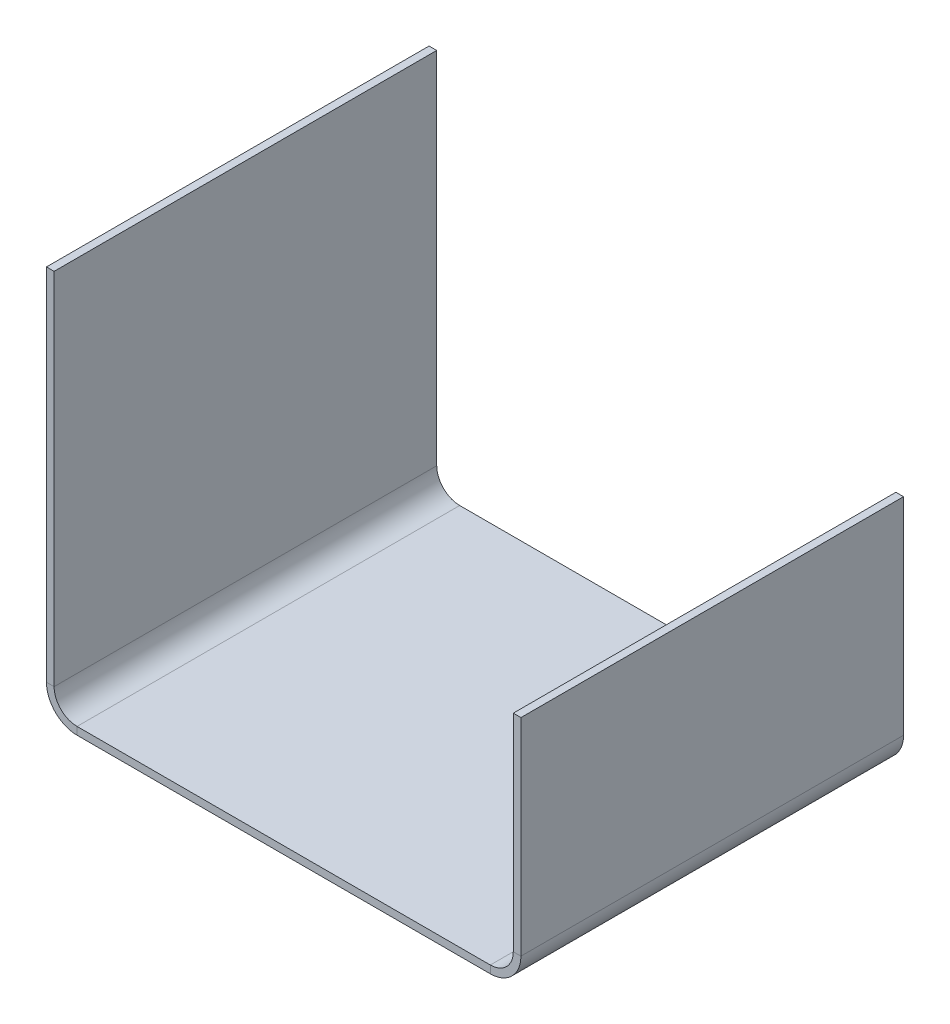
ISO-10303-21;
HEADER;
FILE_DESCRIPTION(('STEP AP214'),'2;1');
FILE_NAME('part.step','',(''),(''),'','','');
FILE_SCHEMA(('AUTOMOTIVE_DESIGN { 1 0 10303 214 1 1 1 1 }'));
ENDSEC;
DATA;
#1=APPLICATION_CONTEXT('core data for automotive mechanical design processes');
#2=APPLICATION_PROTOCOL_DEFINITION('international standard','automotive_design',2000,#1);
#3=PRODUCT_CONTEXT('',#1,'mechanical');
#4=PRODUCT('Part','Part','',(#3));
#5=PRODUCT_RELATED_PRODUCT_CATEGORY('part','',(#4));
#6=PRODUCT_DEFINITION_FORMATION('','',#4);
#7=PRODUCT_DEFINITION_CONTEXT('part definition',#1,'design');
#8=PRODUCT_DEFINITION('design','',#6,#7);
#9=PRODUCT_DEFINITION_SHAPE('','',#8);
#10=(LENGTH_UNIT() NAMED_UNIT(*) SI_UNIT(.MILLI.,.METRE.));
#11=(NAMED_UNIT(*) PLANE_ANGLE_UNIT() SI_UNIT($,.RADIAN.));
#12=(NAMED_UNIT(*) SI_UNIT($,.STERADIAN.) SOLID_ANGLE_UNIT());
#13=UNCERTAINTY_MEASURE_WITH_UNIT(LENGTH_MEASURE(1.E-05),#10,'distance_accuracy_value','');
#14=(GEOMETRIC_REPRESENTATION_CONTEXT(3) GLOBAL_UNCERTAINTY_ASSIGNED_CONTEXT((#13)) GLOBAL_UNIT_ASSIGNED_CONTEXT((#10,
#11,#12)) REPRESENTATION_CONTEXT('',''));
#15=CARTESIAN_POINT('',(0.,0.,0.));
#16=DIRECTION('',(0.,0.,1.));
#17=DIRECTION('',(1.,0.,0.));
#18=AXIS2_PLACEMENT_3D('',#15,#16,#17);
#19=CARTESIAN_POINT('',(-54.,0.,100.));
#20=DIRECTION('',(0.,0.,1.));
#21=DIRECTION('',(1.,0.,0.));
#22=AXIS2_PLACEMENT_3D('',#19,#20,#21);
#23=PLANE('',#22);
#24=DIRECTION('',(0.,-1.,0.));
#25=VECTOR('',#24,1.);
#26=CARTESIAN_POINT('',(-54.,0.,100.));
#27=LINE('',#26,#25);
#28=CARTESIAN_POINT('',(-54.,0.,100.));
#29=VERTEX_POINT('',#28);
#30=CARTESIAN_POINT('',(-54.,-2.,100.));
#31=VERTEX_POINT('',#30);
#32=EDGE_CURVE('E11',#29,#31,#27,.T.);
#33=ORIENTED_EDGE('',*,*,#32,.F.);
#34=CARTESIAN_POINT('',(-54.,6.,100.));
#35=DIRECTION('',(0.,0.,-1.));
#36=DIRECTION('',(-1.,0.,0.));
#37=AXIS2_PLACEMENT_3D('',#34,#35,#36);
#38=CIRCLE('',#37,6.);
#39=CARTESIAN_POINT('',(-60.,6.00000000000001,100.));
#40=VERTEX_POINT('',#39);
#41=EDGE_CURVE('E249',#40,#29,#38,.F.);
#42=ORIENTED_EDGE('',*,*,#41,.F.);
#43=DIRECTION('',(1.,0.,0.));
#44=VECTOR('',#43,1.);
#45=CARTESIAN_POINT('',(-62.,6.,100.));
#46=LINE('',#45,#44);
#47=CARTESIAN_POINT('',(-62.,6.,100.));
#48=VERTEX_POINT('',#47);
#49=EDGE_CURVE('E47',#48,#40,#46,.T.);
#50=ORIENTED_EDGE('',*,*,#49,.F.);
#51=CARTESIAN_POINT('',(-54.,6.,100.));
#52=DIRECTION('',(0.,0.,1.));
#53=DIRECTION('',(1.,0.,0.));
#54=AXIS2_PLACEMENT_3D('',#51,#52,#53);
#55=CIRCLE('',#54,8.);
#56=EDGE_CURVE('E148',#48,#31,#55,.T.);
#57=ORIENTED_EDGE('',*,*,#56,.T.);
#58=EDGE_LOOP('',(#33,#42,#50,#57));
#59=FACE_BOUND('',#58,.T.);
#60=ADVANCED_FACE('F39',(#59),#23,.T.);
#61=CARTESIAN_POINT('',(-62.,6.,100.));
#62=DIRECTION('',(0.,0.,1.));
#63=DIRECTION('',(1.,0.,0.));
#64=AXIS2_PLACEMENT_3D('',#61,#62,#63);
#65=PLANE('',#64);
#66=DIRECTION('',(1.,0.,0.));
#67=VECTOR('',#66,1.);
#68=CARTESIAN_POINT('',(-60.,0.,100.));
#69=LINE('',#68,#67);
#70=CARTESIAN_POINT('',(54.,0.,100.));
#71=VERTEX_POINT('',#70);
#72=EDGE_CURVE('E142',#29,#71,#69,.T.);
#73=ORIENTED_EDGE('',*,*,#72,.F.);
#74=ORIENTED_EDGE('',*,*,#32,.T.);
#75=DIRECTION('',(1.,0.,0.));
#76=VECTOR('',#75,1.);
#77=CARTESIAN_POINT('',(-60.,-2.,100.));
#78=LINE('',#77,#76);
#79=CARTESIAN_POINT('',(54.,-1.99999999999998,100.));
#80=VERTEX_POINT('',#79);
#81=EDGE_CURVE('E139',#31,#80,#78,.T.);
#82=ORIENTED_EDGE('',*,*,#81,.T.);
#83=DIRECTION('',(0.,1.,0.));
#84=VECTOR('',#83,1.);
#85=CARTESIAN_POINT('',(54.,-1.99999999999998,100.));
#86=LINE('',#85,#84);
#87=EDGE_CURVE('E230',#80,#71,#86,.T.);
#88=ORIENTED_EDGE('',*,*,#87,.T.);
#89=EDGE_LOOP('',(#73,#74,#82,#88));
#90=FACE_BOUND('',#89,.T.);
#91=ADVANCED_FACE('F137',(#90),#65,.T.);
#92=CARTESIAN_POINT('',(-60.,6.00000000000001,0.));
#93=DIRECTION('',(0.,0.,-1.));
#94=DIRECTION('',(-1.,0.,0.));
#95=AXIS2_PLACEMENT_3D('',#92,#93,#94);
#96=PLANE('',#95);
#97=DIRECTION('',(-1.,0.,0.));
#98=VECTOR('',#97,1.);
#99=CARTESIAN_POINT('',(-60.,6.00000000000001,0.));
#100=LINE('',#99,#98);
#101=CARTESIAN_POINT('',(-60.,6.00000000000001,0.));
#102=VERTEX_POINT('',#101);
#103=CARTESIAN_POINT('',(-62.,6.,0.));
#104=VERTEX_POINT('',#103);
#105=EDGE_CURVE('E235',#102,#104,#100,.T.);
#106=ORIENTED_EDGE('',*,*,#105,.F.);
#107=CARTESIAN_POINT('',(-54.,6.,0.));
#108=DIRECTION('',(0.,0.,-1.));
#109=DIRECTION('',(-1.,0.,0.));
#110=AXIS2_PLACEMENT_3D('',#107,#108,#109);
#111=CIRCLE('',#110,6.);
#112=CARTESIAN_POINT('',(-54.,0.,0.));
#113=VERTEX_POINT('',#112);
#114=EDGE_CURVE('E187',#102,#113,#111,.F.);
#115=ORIENTED_EDGE('',*,*,#114,.T.);
#116=DIRECTION('',(0.,1.,0.));
#117=VECTOR('',#116,1.);
#118=CARTESIAN_POINT('',(-54.,-2.,0.));
#119=LINE('',#118,#117);
#120=CARTESIAN_POINT('',(-54.,-2.,0.));
#121=VERTEX_POINT('',#120);
#122=EDGE_CURVE('E233',#121,#113,#119,.T.);
#123=ORIENTED_EDGE('',*,*,#122,.F.);
#124=CARTESIAN_POINT('',(-54.,6.,0.));
#125=DIRECTION('',(0.,0.,1.));
#126=DIRECTION('',(1.,0.,0.));
#127=AXIS2_PLACEMENT_3D('',#124,#125,#126);
#128=CIRCLE('',#127,8.);
#129=EDGE_CURVE('E160',#104,#121,#128,.T.);
#130=ORIENTED_EDGE('',*,*,#129,.F.);
#131=EDGE_LOOP('',(#106,#115,#123,#130));
#132=FACE_BOUND('',#131,.T.);
#133=ADVANCED_FACE('F287',(#132),#96,.T.);
#134=CARTESIAN_POINT('',(-54.,-2.,0.));
#135=DIRECTION('',(0.,0.,-1.));
#136=DIRECTION('',(-1.,0.,0.));
#137=AXIS2_PLACEMENT_3D('',#134,#135,#136);
#138=PLANE('',#137);
#139=DIRECTION('',(0.,-1.,0.));
#140=VECTOR('',#139,1.);
#141=CARTESIAN_POINT('',(-60.,100.,0.));
#142=LINE('',#141,#140);
#143=CARTESIAN_POINT('',(-60.,100.,0.));
#144=VERTEX_POINT('',#143);
#145=EDGE_CURVE('E190',#144,#102,#142,.T.);
#146=ORIENTED_EDGE('',*,*,#145,.T.);
#147=ORIENTED_EDGE('',*,*,#105,.T.);
#148=DIRECTION('',(0.,-1.,0.));
#149=VECTOR('',#148,1.);
#150=CARTESIAN_POINT('',(-62.,100.,0.));
#151=LINE('',#150,#149);
#152=CARTESIAN_POINT('',(-62.,100.,0.));
#153=VERTEX_POINT('',#152);
#154=EDGE_CURVE('E196',#153,#104,#151,.T.);
#155=ORIENTED_EDGE('',*,*,#154,.F.);
#156=DIRECTION('',(1.,0.,0.));
#157=VECTOR('',#156,1.);
#158=CARTESIAN_POINT('',(-62.,100.,0.));
#159=LINE('',#158,#157);
#160=EDGE_CURVE('E193',#153,#144,#159,.T.);
#161=ORIENTED_EDGE('',*,*,#160,.T.);
#162=EDGE_LOOP('',(#146,#147,#155,#161));
#163=FACE_BOUND('',#162,.T.);
#164=ADVANCED_FACE('F290',(#163),#138,.T.);
#165=CARTESIAN_POINT('',(60.,6.00000000000002,100.));
#166=DIRECTION('',(0.,0.,1.));
#167=DIRECTION('',(1.,0.,0.));
#168=AXIS2_PLACEMENT_3D('',#165,#166,#167);
#169=PLANE('',#168);
#170=DIRECTION('',(1.,0.,0.));
#171=VECTOR('',#170,1.);
#172=CARTESIAN_POINT('',(60.,6.00000000000002,100.));
#173=LINE('',#172,#171);
#174=CARTESIAN_POINT('',(60.,6.00000000000002,100.));
#175=VERTEX_POINT('',#174);
#176=CARTESIAN_POINT('',(62.,6.00000000000002,100.));
#177=VERTEX_POINT('',#176);
#178=EDGE_CURVE('E55',#175,#177,#173,.T.);
#179=ORIENTED_EDGE('',*,*,#178,.F.);
#180=CARTESIAN_POINT('',(54.,6.00000000000002,100.));
#181=DIRECTION('',(0.,0.,-1.));
#182=DIRECTION('',(-1.,0.,0.));
#183=AXIS2_PLACEMENT_3D('',#180,#181,#182);
#184=CIRCLE('',#183,6.);
#185=EDGE_CURVE('E259',#71,#175,#184,.F.);
#186=ORIENTED_EDGE('',*,*,#185,.F.);
#187=ORIENTED_EDGE('',*,*,#87,.F.);
#188=CARTESIAN_POINT('',(54.,6.00000000000002,100.));
#189=DIRECTION('',(0.,0.,1.));
#190=DIRECTION('',(1.,0.,0.));
#191=AXIS2_PLACEMENT_3D('',#188,#189,#190);
#192=CIRCLE('',#191,8.);
#193=EDGE_CURVE('E168',#80,#177,#192,.T.);
#194=ORIENTED_EDGE('',*,*,#193,.T.);
#195=EDGE_LOOP('',(#179,#186,#187,#194));
#196=FACE_BOUND('',#195,.T.);
#197=ADVANCED_FACE('F282',(#196),#169,.T.);
#198=CARTESIAN_POINT('',(54.,-1.99999999999998,100.));
#199=DIRECTION('',(0.,0.,1.));
#200=DIRECTION('',(1.,0.,0.));
#201=AXIS2_PLACEMENT_3D('',#198,#199,#200);
#202=PLANE('',#201);
#203=DIRECTION('',(0.,1.,0.));
#204=VECTOR('',#203,1.);
#205=CARTESIAN_POINT('',(60.,0.,100.));
#206=LINE('',#205,#204);
#207=CARTESIAN_POINT('',(60.,60.,100.));
#208=VERTEX_POINT('',#207);
#209=EDGE_CURVE('E262',#175,#208,#206,.T.);
#210=ORIENTED_EDGE('',*,*,#209,.F.);
#211=ORIENTED_EDGE('',*,*,#178,.T.);
#212=DIRECTION('',(0.,1.,0.));
#213=VECTOR('',#212,1.);
#214=CARTESIAN_POINT('',(62.,0.,100.));
#215=LINE('',#214,#213);
#216=CARTESIAN_POINT('',(62.,60.,100.));
#217=VERTEX_POINT('',#216);
#218=EDGE_CURVE('E109',#177,#217,#215,.T.);
#219=ORIENTED_EDGE('',*,*,#218,.T.);
#220=DIRECTION('',(1.,0.,0.));
#221=VECTOR('',#220,1.);
#222=CARTESIAN_POINT('',(60.,60.,100.));
#223=LINE('',#222,#221);
#224=EDGE_CURVE('E265',#208,#217,#223,.T.);
#225=ORIENTED_EDGE('',*,*,#224,.F.);
#226=EDGE_LOOP('',(#210,#211,#219,#225));
#227=FACE_BOUND('',#226,.T.);
#228=ADVANCED_FACE('F271',(#227),#202,.T.);
#229=CARTESIAN_POINT('',(54.,0.,0.));
#230=DIRECTION('',(0.,0.,-1.));
#231=DIRECTION('',(-1.,0.,0.));
#232=AXIS2_PLACEMENT_3D('',#229,#230,#231);
#233=PLANE('',#232);
#234=DIRECTION('',(0.,-1.,0.));
#235=VECTOR('',#234,1.);
#236=CARTESIAN_POINT('',(54.,0.,0.));
#237=LINE('',#236,#235);
#238=CARTESIAN_POINT('',(54.,0.,0.));
#239=VERTEX_POINT('',#238);
#240=CARTESIAN_POINT('',(54.,-1.99999999999998,0.));
#241=VERTEX_POINT('',#240);
#242=EDGE_CURVE('E96',#239,#241,#237,.T.);
#243=ORIENTED_EDGE('',*,*,#242,.F.);
#244=CARTESIAN_POINT('',(54.,6.00000000000002,0.));
#245=DIRECTION('',(0.,0.,-1.));
#246=DIRECTION('',(-1.,0.,0.));
#247=AXIS2_PLACEMENT_3D('',#244,#245,#246);
#248=CIRCLE('',#247,6.);
#249=CARTESIAN_POINT('',(60.,6.00000000000002,0.));
#250=VERTEX_POINT('',#249);
#251=EDGE_CURVE('E183',#239,#250,#248,.F.);
#252=ORIENTED_EDGE('',*,*,#251,.T.);
#253=DIRECTION('',(-1.,0.,0.));
#254=VECTOR('',#253,1.);
#255=CARTESIAN_POINT('',(62.,6.00000000000002,0.));
#256=LINE('',#255,#254);
#257=CARTESIAN_POINT('',(62.,6.00000000000002,0.));
#258=VERTEX_POINT('',#257);
#259=EDGE_CURVE('E103',#258,#250,#256,.T.);
#260=ORIENTED_EDGE('',*,*,#259,.F.);
#261=CARTESIAN_POINT('',(54.,6.00000000000002,0.));
#262=DIRECTION('',(0.,0.,1.));
#263=DIRECTION('',(1.,0.,0.));
#264=AXIS2_PLACEMENT_3D('',#261,#262,#263);
#265=CIRCLE('',#264,8.);
#266=EDGE_CURVE('E202',#241,#258,#265,.T.);
#267=ORIENTED_EDGE('',*,*,#266,.F.);
#268=EDGE_LOOP('',(#243,#252,#260,#267));
#269=FACE_BOUND('',#268,.T.);
#270=ADVANCED_FACE('F319',(#269),#233,.T.);
#271=CARTESIAN_POINT('',(62.,6.00000000000002,0.));
#272=DIRECTION('',(0.,0.,-1.));
#273=DIRECTION('',(-1.,0.,0.));
#274=AXIS2_PLACEMENT_3D('',#271,#272,#273);
#275=PLANE('',#274);
#276=DIRECTION('',(1.,0.,0.));
#277=VECTOR('',#276,1.);
#278=CARTESIAN_POINT('',(-60.,0.,0.));
#279=LINE('',#278,#277);
#280=EDGE_CURVE('E185',#113,#239,#279,.T.);
#281=ORIENTED_EDGE('',*,*,#280,.T.);
#282=ORIENTED_EDGE('',*,*,#242,.T.);
#283=DIRECTION('',(1.,0.,0.));
#284=VECTOR('',#283,1.);
#285=CARTESIAN_POINT('',(-60.,-2.,0.));
#286=LINE('',#285,#284);
#287=EDGE_CURVE('E200',#121,#241,#286,.T.);
#288=ORIENTED_EDGE('',*,*,#287,.F.);
#289=ORIENTED_EDGE('',*,*,#122,.T.);
#290=EDGE_LOOP('',(#281,#282,#288,#289));
#291=FACE_BOUND('',#290,.T.);
#292=ADVANCED_FACE('F322',(#291),#275,.T.);
#293=CARTESIAN_POINT('',(62.,0.,100.));
#294=DIRECTION('',(-1.,0.,0.));
#295=DIRECTION('',(0.,0.,1.));
#296=AXIS2_PLACEMENT_3D('',#293,#294,#295);
#297=PLANE('',#296);
#298=DIRECTION('',(0.,1.,0.));
#299=VECTOR('',#298,1.);
#300=CARTESIAN_POINT('',(62.,0.,0.));
#301=LINE('',#300,#299);
#302=CARTESIAN_POINT('',(62.,60.,0.));
#303=VERTEX_POINT('',#302);
#304=EDGE_CURVE('E174',#258,#303,#301,.T.);
#305=ORIENTED_EDGE('',*,*,#304,.T.);
#306=DIRECTION('',(0.,0.,-1.));
#307=VECTOR('',#306,1.);
#308=CARTESIAN_POINT('',(62.,60.,100.));
#309=LINE('',#308,#307);
#310=EDGE_CURVE('E226',#217,#303,#309,.T.);
#311=ORIENTED_EDGE('',*,*,#310,.F.);
#312=ORIENTED_EDGE('',*,*,#218,.F.);
#313=DIRECTION('',(0.,0.,-1.));
#314=VECTOR('',#313,1.);
#315=CARTESIAN_POINT('',(62.,6.00000000000002,100.));
#316=LINE('',#315,#314);
#317=EDGE_CURVE('E170',#177,#258,#316,.T.);
#318=ORIENTED_EDGE('',*,*,#317,.T.);
#319=EDGE_LOOP('',(#305,#311,#312,#318));
#320=FACE_BOUND('',#319,.T.);
#321=ADVANCED_FACE('F325',(#320),#297,.F.);
#322=CARTESIAN_POINT('',(60.,60.,100.));
#323=DIRECTION('',(0.,1.,0.));
#324=DIRECTION('',(0.,0.,1.));
#325=AXIS2_PLACEMENT_3D('',#322,#323,#324);
#326=PLANE('',#325);
#327=DIRECTION('',(1.,0.,0.));
#328=VECTOR('',#327,1.);
#329=CARTESIAN_POINT('',(60.,60.,0.));
#330=LINE('',#329,#328);
#331=CARTESIAN_POINT('',(60.,60.,0.));
#332=VERTEX_POINT('',#331);
#333=EDGE_CURVE('E177',#332,#303,#330,.T.);
#334=ORIENTED_EDGE('',*,*,#333,.F.);
#335=DIRECTION('',(0.,0.,-1.));
#336=VECTOR('',#335,1.);
#337=CARTESIAN_POINT('',(60.,60.,100.));
#338=LINE('',#337,#336);
#339=EDGE_CURVE('E224',#208,#332,#338,.T.);
#340=ORIENTED_EDGE('',*,*,#339,.F.);
#341=ORIENTED_EDGE('',*,*,#224,.T.);
#342=ORIENTED_EDGE('',*,*,#310,.T.);
#343=EDGE_LOOP('',(#334,#340,#341,#342));
#344=FACE_BOUND('',#343,.T.);
#345=ADVANCED_FACE('F270',(#344),#326,.T.);
#346=CARTESIAN_POINT('',(60.,0.,100.));
#347=DIRECTION('',(-1.,0.,0.));
#348=DIRECTION('',(0.,0.,1.));
#349=AXIS2_PLACEMENT_3D('',#346,#347,#348);
#350=PLANE('',#349);
#351=DIRECTION('',(0.,1.,0.));
#352=VECTOR('',#351,1.);
#353=CARTESIAN_POINT('',(60.,0.,0.));
#354=LINE('',#353,#352);
#355=EDGE_CURVE('E180',#250,#332,#354,.T.);
#356=ORIENTED_EDGE('',*,*,#355,.F.);
#357=DIRECTION('',(0.,0.,-1.));
#358=VECTOR('',#357,1.);
#359=CARTESIAN_POINT('',(60.,6.00000000000002,100.));
#360=LINE('',#359,#358);
#361=EDGE_CURVE('E221',#175,#250,#360,.T.);
#362=ORIENTED_EDGE('',*,*,#361,.F.);
#363=ORIENTED_EDGE('',*,*,#209,.T.);
#364=ORIENTED_EDGE('',*,*,#339,.T.);
#365=EDGE_LOOP('',(#356,#362,#363,#364));
#366=FACE_BOUND('',#365,.T.);
#367=ADVANCED_FACE('F275',(#366),#350,.T.);
#368=CARTESIAN_POINT('',(54.,6.00000000000002,100.));
#369=DIRECTION('',(0.,0.,-1.));
#370=DIRECTION('',(-1.,0.,0.));
#371=AXIS2_PLACEMENT_3D('',#368,#369,#370);
#372=CYLINDRICAL_SURFACE('',#371,6.);
#373=ORIENTED_EDGE('',*,*,#251,.F.);
#374=DIRECTION('',(0.,0.,-1.));
#375=VECTOR('',#374,1.);
#376=CARTESIAN_POINT('',(54.,0.,100.));
#377=LINE('',#376,#375);
#378=EDGE_CURVE('E218',#71,#239,#377,.T.);
#379=ORIENTED_EDGE('',*,*,#378,.F.);
#380=ORIENTED_EDGE('',*,*,#185,.T.);
#381=ORIENTED_EDGE('',*,*,#361,.T.);
#382=EDGE_LOOP('',(#373,#379,#380,#381));
#383=FACE_BOUND('',#382,.T.);
#384=ADVANCED_FACE('F278',(#383),#372,.F.);
#385=CARTESIAN_POINT('',(-60.,0.,100.));
#386=DIRECTION('',(0.,1.,0.));
#387=DIRECTION('',(-1.,0.,0.));
#388=AXIS2_PLACEMENT_3D('',#385,#386,#387);
#389=PLANE('',#388);
#390=ORIENTED_EDGE('',*,*,#280,.F.);
#391=DIRECTION('',(0.,0.,-1.));
#392=VECTOR('',#391,1.);
#393=CARTESIAN_POINT('',(-54.,0.,100.));
#394=LINE('',#393,#392);
#395=EDGE_CURVE('E215',#29,#113,#394,.T.);
#396=ORIENTED_EDGE('',*,*,#395,.F.);
#397=ORIENTED_EDGE('',*,*,#72,.T.);
#398=ORIENTED_EDGE('',*,*,#378,.T.);
#399=EDGE_LOOP('',(#390,#396,#397,#398));
#400=FACE_BOUND('',#399,.T.);
#401=ADVANCED_FACE('F285',(#400),#389,.T.);
#402=CARTESIAN_POINT('',(-54.,6.,100.));
#403=DIRECTION('',(0.,0.,-1.));
#404=DIRECTION('',(-1.,0.,0.));
#405=AXIS2_PLACEMENT_3D('',#402,#403,#404);
#406=CYLINDRICAL_SURFACE('',#405,6.);
#407=ORIENTED_EDGE('',*,*,#114,.F.);
#408=DIRECTION('',(0.,0.,-1.));
#409=VECTOR('',#408,1.);
#410=CARTESIAN_POINT('',(-60.,6.00000000000001,100.));
#411=LINE('',#410,#409);
#412=EDGE_CURVE('E212',#40,#102,#411,.T.);
#413=ORIENTED_EDGE('',*,*,#412,.F.);
#414=ORIENTED_EDGE('',*,*,#41,.T.);
#415=ORIENTED_EDGE('',*,*,#395,.T.);
#416=EDGE_LOOP('',(#407,#413,#414,#415));
#417=FACE_BOUND('',#416,.T.);
#418=ADVANCED_FACE('F248',(#417),#406,.F.);
#419=CARTESIAN_POINT('',(-60.,100.,100.));
#420=DIRECTION('',(1.,0.,0.));
#421=DIRECTION('',(0.,1.,0.));
#422=AXIS2_PLACEMENT_3D('',#419,#420,#421);
#423=PLANE('',#422);
#424=ORIENTED_EDGE('',*,*,#145,.F.);
#425=DIRECTION('',(0.,0.,-1.));
#426=VECTOR('',#425,1.);
#427=CARTESIAN_POINT('',(-60.,100.,100.));
#428=LINE('',#427,#426);
#429=CARTESIAN_POINT('',(-60.,100.,100.));
#430=VERTEX_POINT('',#429);
#431=EDGE_CURVE('E210',#430,#144,#428,.T.);
#432=ORIENTED_EDGE('',*,*,#431,.F.);
#433=DIRECTION('',(0.,-1.,0.));
#434=VECTOR('',#433,1.);
#435=CARTESIAN_POINT('',(-60.,100.,100.));
#436=LINE('',#435,#434);
#437=EDGE_CURVE('E242',#430,#40,#436,.T.);
#438=ORIENTED_EDGE('',*,*,#437,.T.);
#439=ORIENTED_EDGE('',*,*,#412,.T.);
#440=EDGE_LOOP('',(#424,#432,#438,#439));
#441=FACE_BOUND('',#440,.T.);
#442=ADVANCED_FACE('F253',(#441),#423,.T.);
#443=CARTESIAN_POINT('',(-62.,100.,100.));
#444=DIRECTION('',(0.,1.,0.));
#445=DIRECTION('',(0.,0.,1.));
#446=AXIS2_PLACEMENT_3D('',#443,#444,#445);
#447=PLANE('',#446);
#448=ORIENTED_EDGE('',*,*,#160,.F.);
#449=DIRECTION('',(0.,0.,-1.));
#450=VECTOR('',#449,1.);
#451=CARTESIAN_POINT('',(-62.,100.,100.));
#452=LINE('',#451,#450);
#453=CARTESIAN_POINT('',(-62.,100.,100.));
#454=VERTEX_POINT('',#453);
#455=EDGE_CURVE('E208',#454,#153,#452,.T.);
#456=ORIENTED_EDGE('',*,*,#455,.F.);
#457=DIRECTION('',(1.,0.,0.));
#458=VECTOR('',#457,1.);
#459=CARTESIAN_POINT('',(-62.,100.,100.));
#460=LINE('',#459,#458);
#461=EDGE_CURVE('E254',#454,#430,#460,.T.);
#462=ORIENTED_EDGE('',*,*,#461,.T.);
#463=ORIENTED_EDGE('',*,*,#431,.T.);
#464=EDGE_LOOP('',(#448,#456,#462,#463));
#465=FACE_BOUND('',#464,.T.);
#466=ADVANCED_FACE('F295',(#465),#447,.T.);
#467=CARTESIAN_POINT('',(-62.,100.,100.));
#468=DIRECTION('',(1.,0.,0.));
#469=DIRECTION('',(0.,1.,0.));
#470=AXIS2_PLACEMENT_3D('',#467,#468,#469);
#471=PLANE('',#470);
#472=ORIENTED_EDGE('',*,*,#154,.T.);
#473=DIRECTION('',(0.,0.,-1.));
#474=VECTOR('',#473,1.);
#475=CARTESIAN_POINT('',(-62.,6.,100.));
#476=LINE('',#475,#474);
#477=EDGE_CURVE('E162',#48,#104,#476,.T.);
#478=ORIENTED_EDGE('',*,*,#477,.F.);
#479=DIRECTION('',(0.,-1.,0.));
#480=VECTOR('',#479,1.);
#481=CARTESIAN_POINT('',(-62.,100.,100.));
#482=LINE('',#481,#480);
#483=EDGE_CURVE('E153',#454,#48,#482,.T.);
#484=ORIENTED_EDGE('',*,*,#483,.F.);
#485=ORIENTED_EDGE('',*,*,#455,.T.);
#486=EDGE_LOOP('',(#472,#478,#484,#485));
#487=FACE_BOUND('',#486,.T.);
#488=ADVANCED_FACE('F293',(#487),#471,.F.);
#489=CARTESIAN_POINT('',(-54.,6.,100.));
#490=DIRECTION('',(0.,0.,-1.));
#491=DIRECTION('',(-1.,0.,0.));
#492=AXIS2_PLACEMENT_3D('',#489,#490,#491);
#493=CYLINDRICAL_SURFACE('',#492,8.);
#494=ORIENTED_EDGE('',*,*,#129,.T.);
#495=DIRECTION('',(0.,0.,-1.));
#496=VECTOR('',#495,1.);
#497=CARTESIAN_POINT('',(-54.,-2.,100.));
#498=LINE('',#497,#496);
#499=EDGE_CURVE('E157',#31,#121,#498,.T.);
#500=ORIENTED_EDGE('',*,*,#499,.F.);
#501=ORIENTED_EDGE('',*,*,#56,.F.);
#502=ORIENTED_EDGE('',*,*,#477,.T.);
#503=EDGE_LOOP('',(#494,#500,#501,#502));
#504=FACE_BOUND('',#503,.T.);
#505=ADVANCED_FACE('F158',(#504),#493,.T.);
#506=CARTESIAN_POINT('',(-60.,-2.,100.));
#507=DIRECTION('',(0.,1.,0.));
#508=DIRECTION('',(-1.,0.,0.));
#509=AXIS2_PLACEMENT_3D('',#506,#507,#508);
#510=PLANE('',#509);
#511=ORIENTED_EDGE('',*,*,#287,.T.);
#512=DIRECTION('',(0.,0.,-1.));
#513=VECTOR('',#512,1.);
#514=CARTESIAN_POINT('',(54.,-1.99999999999998,100.));
#515=LINE('',#514,#513);
#516=EDGE_CURVE('E163',#80,#241,#515,.T.);
#517=ORIENTED_EDGE('',*,*,#516,.F.);
#518=ORIENTED_EDGE('',*,*,#81,.F.);
#519=ORIENTED_EDGE('',*,*,#499,.T.);
#520=EDGE_LOOP('',(#511,#517,#518,#519));
#521=FACE_BOUND('',#520,.T.);
#522=ADVANCED_FACE('F165',(#521),#510,.F.);
#523=CARTESIAN_POINT('',(54.,6.00000000000002,100.));
#524=DIRECTION('',(0.,0.,-1.));
#525=DIRECTION('',(-1.,0.,0.));
#526=AXIS2_PLACEMENT_3D('',#523,#524,#525);
#527=CYLINDRICAL_SURFACE('',#526,8.);
#528=ORIENTED_EDGE('',*,*,#266,.T.);
#529=ORIENTED_EDGE('',*,*,#317,.F.);
#530=ORIENTED_EDGE('',*,*,#193,.F.);
#531=ORIENTED_EDGE('',*,*,#516,.T.);
#532=EDGE_LOOP('',(#528,#529,#530,#531));
#533=FACE_BOUND('',#532,.T.);
#534=ADVANCED_FACE('F377',(#533),#527,.T.);
#535=CARTESIAN_POINT('',(54.,6.00000000000002,100.));
#536=DIRECTION('',(0.,0.,-1.));
#537=DIRECTION('',(-1.,0.,0.));
#538=AXIS2_PLACEMENT_3D('',#535,#536,#537);
#539=PLANE('',#538);
#540=ORIENTED_EDGE('',*,*,#483,.T.);
#541=ORIENTED_EDGE('',*,*,#49,.T.);
#542=ORIENTED_EDGE('',*,*,#437,.F.);
#543=ORIENTED_EDGE('',*,*,#461,.F.);
#544=EDGE_LOOP('',(#540,#541,#542,#543));
#545=FACE_BOUND('',#544,.T.);
#546=ADVANCED_FACE('F239',(#545),#539,.F.);
#547=CARTESIAN_POINT('',(54.,6.00000000000002,0.));
#548=DIRECTION('',(0.,0.,-1.));
#549=DIRECTION('',(-1.,0.,0.));
#550=AXIS2_PLACEMENT_3D('',#547,#548,#549);
#551=PLANE('',#550);
#552=ORIENTED_EDGE('',*,*,#304,.F.);
#553=ORIENTED_EDGE('',*,*,#259,.T.);
#554=ORIENTED_EDGE('',*,*,#355,.T.);
#555=ORIENTED_EDGE('',*,*,#333,.T.);
#556=EDGE_LOOP('',(#552,#553,#554,#555));
#557=FACE_BOUND('',#556,.T.);
#558=ADVANCED_FACE('F397',(#557),#551,.T.);
#559=CLOSED_SHELL('',(#60,#91,#133,#164,#197,#228,#270,#292,#321,#345,#367,#384,#401,#418,#442,
#466,#488,#505,#522,#534,#546,#558));
#560=MANIFOLD_SOLID_BREP('B2',#559);
#561=ADVANCED_BREP_SHAPE_REPRESENTATION('',(#18,#560),#14);
#562=SHAPE_DEFINITION_REPRESENTATION(#9,#561);
ENDSEC;
END-ISO-10303-21;
